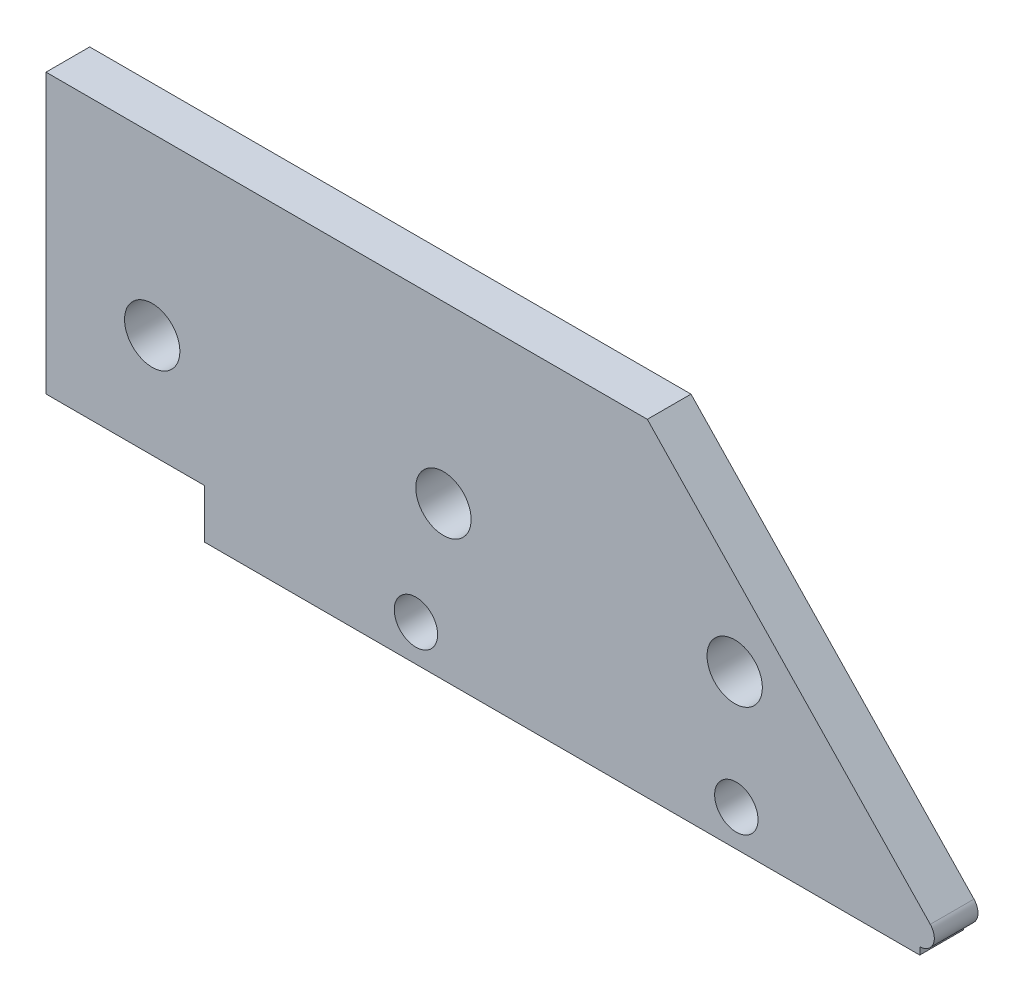
ISO-10303-21;
HEADER;
FILE_DESCRIPTION(('STEP AP214'),'2;1');
FILE_NAME('part.step','',(''),(''),'','','');
FILE_SCHEMA(('AUTOMOTIVE_DESIGN { 1 0 10303 214 1 1 1 1 }'));
ENDSEC;
DATA;
#1=APPLICATION_CONTEXT('core data for automotive mechanical design processes');
#2=APPLICATION_PROTOCOL_DEFINITION('international standard','automotive_design',2000,#1);
#3=PRODUCT_CONTEXT('',#1,'mechanical');
#4=PRODUCT('Part','Part','',(#3));
#5=PRODUCT_RELATED_PRODUCT_CATEGORY('part','',(#4));
#6=PRODUCT_DEFINITION_FORMATION('','',#4);
#7=PRODUCT_DEFINITION_CONTEXT('part definition',#1,'design');
#8=PRODUCT_DEFINITION('design','',#6,#7);
#9=PRODUCT_DEFINITION_SHAPE('','',#8);
#10=(LENGTH_UNIT() NAMED_UNIT(*) SI_UNIT(.MILLI.,.METRE.));
#11=(NAMED_UNIT(*) PLANE_ANGLE_UNIT() SI_UNIT($,.RADIAN.));
#12=(NAMED_UNIT(*) SI_UNIT($,.STERADIAN.) SOLID_ANGLE_UNIT());
#13=UNCERTAINTY_MEASURE_WITH_UNIT(LENGTH_MEASURE(1.E-05),#10,'distance_accuracy_value','');
#14=(GEOMETRIC_REPRESENTATION_CONTEXT(3) GLOBAL_UNCERTAINTY_ASSIGNED_CONTEXT((#13)) GLOBAL_UNIT_ASSIGNED_CONTEXT((#10,
#11,#12)) REPRESENTATION_CONTEXT('',''));
#15=CARTESIAN_POINT('',(0.,0.,0.));
#16=DIRECTION('',(0.,0.,1.));
#17=DIRECTION('',(1.,0.,0.));
#18=AXIS2_PLACEMENT_3D('',#15,#16,#17);
#19=CARTESIAN_POINT('',(105.301358772641,1.37499999999999,3.));
#20=DIRECTION('',(0.,0.,-1.));
#21=DIRECTION('',(-1.,0.,0.));
#22=AXIS2_PLACEMENT_3D('',#19,#20,#21);
#23=CYLINDRICAL_SURFACE('',#22,0.999999999999998);
#24=CARTESIAN_POINT('',(105.301358772641,1.37499999999999,0.));
#25=DIRECTION('',(0.,0.,1.));
#26=DIRECTION('',(1.,0.,0.));
#27=AXIS2_PLACEMENT_3D('',#24,#25,#26);
#28=CIRCLE('',#27,0.999999999999998);
#29=CARTESIAN_POINT('',(105.301358772641,0.374999999999994,0.));
#30=VERTEX_POINT('',#29);
#31=CARTESIAN_POINT('',(106.024068330656,2.06615186084797,0.));
#32=VERTEX_POINT('',#31);
#33=EDGE_CURVE('E172',#30,#32,#28,.T.);
#34=ORIENTED_EDGE('',*,*,#33,.T.);
#35=DIRECTION('',(0.,0.,-1.));
#36=VECTOR('',#35,1.);
#37=CARTESIAN_POINT('',(106.024068330656,2.06615186084797,3.));
#38=LINE('',#37,#36);
#39=CARTESIAN_POINT('',(106.024068330656,2.06615186084797,3.));
#40=VERTEX_POINT('',#39);
#41=EDGE_CURVE('E190',#40,#32,#38,.T.);
#42=ORIENTED_EDGE('',*,*,#41,.F.);
#43=CARTESIAN_POINT('',(105.301358772641,1.37499999999999,3.));
#44=DIRECTION('',(0.,0.,1.));
#45=DIRECTION('',(1.,0.,0.));
#46=AXIS2_PLACEMENT_3D('',#43,#44,#45);
#47=CIRCLE('',#46,0.999999999999998);
#48=CARTESIAN_POINT('',(105.301358772641,0.374999999999994,3.));
#49=VERTEX_POINT('',#48);
#50=EDGE_CURVE('E84',#49,#40,#47,.T.);
#51=ORIENTED_EDGE('',*,*,#50,.F.);
#52=DIRECTION('',(0.,0.,-1.));
#53=VECTOR('',#52,1.);
#54=CARTESIAN_POINT('',(105.301358772641,0.374999999999994,3.));
#55=LINE('',#54,#53);
#56=EDGE_CURVE('E40',#49,#30,#55,.T.);
#57=ORIENTED_EDGE('',*,*,#56,.T.);
#58=EDGE_LOOP('',(#34,#42,#51,#57));
#59=FACE_BOUND('',#58,.T.);
#60=ADVANCED_FACE('F33',(#59),#23,.T.);
#61=CARTESIAN_POINT('',(106.024068330656,2.06615186084797,3.));
#62=DIRECTION('',(-0.722709558015101,-0.691151860847974,0.));
#63=DIRECTION('',(0.691151860847974,-0.722709558015101,0.));
#64=AXIS2_PLACEMENT_3D('',#61,#62,#63);
#65=PLANE('',#64);
#66=DIRECTION('',(-0.691151860847974,0.722709558015101,0.));
#67=VECTOR('',#66,1.);
#68=CARTESIAN_POINT('',(106.024068330656,2.06615186084797,0.));
#69=LINE('',#68,#67);
#70=CARTESIAN_POINT('',(86.5935335759817,22.3838764884269,0.));
#71=VERTEX_POINT('',#70);
#72=EDGE_CURVE('E182',#32,#71,#69,.T.);
#73=ORIENTED_EDGE('',*,*,#72,.T.);
#74=DIRECTION('',(0.,0.,-1.));
#75=VECTOR('',#74,1.);
#76=CARTESIAN_POINT('',(86.5935335759817,22.3838764884269,3.));
#77=LINE('',#76,#75);
#78=CARTESIAN_POINT('',(86.5935335759817,22.3838764884269,3.));
#79=VERTEX_POINT('',#78);
#80=EDGE_CURVE('E188',#79,#71,#77,.T.);
#81=ORIENTED_EDGE('',*,*,#80,.F.);
#82=DIRECTION('',(-0.691151860847974,0.722709558015101,0.));
#83=VECTOR('',#82,1.);
#84=CARTESIAN_POINT('',(106.024068330656,2.06615186084797,3.));
#85=LINE('',#84,#83);
#86=EDGE_CURVE('E174',#40,#79,#85,.T.);
#87=ORIENTED_EDGE('',*,*,#86,.F.);
#88=ORIENTED_EDGE('',*,*,#41,.T.);
#89=EDGE_LOOP('',(#73,#81,#87,#88));
#90=FACE_BOUND('',#89,.T.);
#91=ADVANCED_FACE('F208',(#90),#65,.F.);
#92=CARTESIAN_POINT('',(86.5935335759817,22.3838764884269,3.));
#93=DIRECTION('',(0.,-1.,0.));
#94=DIRECTION('',(1.,0.,0.));
#95=AXIS2_PLACEMENT_3D('',#92,#93,#94);
#96=PLANE('',#95);
#97=DIRECTION('',(-1.,0.,0.));
#98=VECTOR('',#97,1.);
#99=CARTESIAN_POINT('',(86.5935335759817,22.3838764884269,0.));
#100=LINE('',#99,#98);
#101=CARTESIAN_POINT('',(45.301358772641,22.3838764884269,0.));
#102=VERTEX_POINT('',#101);
#103=EDGE_CURVE('E77',#71,#102,#100,.T.);
#104=ORIENTED_EDGE('',*,*,#103,.T.);
#105=DIRECTION('',(0.,0.,-1.));
#106=VECTOR('',#105,1.);
#107=CARTESIAN_POINT('',(45.301358772641,22.3838764884269,3.));
#108=LINE('',#107,#106);
#109=CARTESIAN_POINT('',(45.301358772641,22.3838764884269,3.));
#110=VERTEX_POINT('',#109);
#111=EDGE_CURVE('E180',#110,#102,#108,.T.);
#112=ORIENTED_EDGE('',*,*,#111,.F.);
#113=DIRECTION('',(-1.,0.,0.));
#114=VECTOR('',#113,1.);
#115=CARTESIAN_POINT('',(86.5935335759817,22.3838764884269,3.));
#116=LINE('',#115,#114);
#117=EDGE_CURVE('E56',#79,#110,#116,.T.);
#118=ORIENTED_EDGE('',*,*,#117,.F.);
#119=ORIENTED_EDGE('',*,*,#80,.T.);
#120=EDGE_LOOP('',(#104,#112,#118,#119));
#121=FACE_BOUND('',#120,.T.);
#122=ADVANCED_FACE('F204',(#121),#96,.F.);
#123=CARTESIAN_POINT('',(45.301358772641,22.3838764884269,3.));
#124=DIRECTION('',(1.,0.,0.));
#125=DIRECTION('',(0.,0.,-1.));
#126=AXIS2_PLACEMENT_3D('',#123,#124,#125);
#127=PLANE('',#126);
#128=DIRECTION('',(0.,-1.,0.));
#129=VECTOR('',#128,1.);
#130=CARTESIAN_POINT('',(45.301358772641,22.3838764884269,0.));
#131=LINE('',#130,#129);
#132=CARTESIAN_POINT('',(45.301358772641,3.24246980337965,0.));
#133=VERTEX_POINT('',#132);
#134=EDGE_CURVE('E175',#102,#133,#131,.T.);
#135=ORIENTED_EDGE('',*,*,#134,.T.);
#136=DIRECTION('',(0.,0.,1.));
#137=VECTOR('',#136,1.);
#138=CARTESIAN_POINT('',(45.301358772641,3.24246980337965,0.));
#139=LINE('',#138,#137);
#140=CARTESIAN_POINT('',(45.301358772641,3.24246980337965,3.));
#141=VERTEX_POINT('',#140);
#142=EDGE_CURVE('E115',#133,#141,#139,.T.);
#143=ORIENTED_EDGE('',*,*,#142,.T.);
#144=DIRECTION('',(0.,-1.,0.));
#145=VECTOR('',#144,1.);
#146=CARTESIAN_POINT('',(45.301358772641,22.3838764884269,3.));
#147=LINE('',#146,#145);
#148=EDGE_CURVE('E178',#110,#141,#147,.T.);
#149=ORIENTED_EDGE('',*,*,#148,.F.);
#150=ORIENTED_EDGE('',*,*,#111,.T.);
#151=EDGE_LOOP('',(#135,#143,#149,#150));
#152=FACE_BOUND('',#151,.T.);
#153=ADVANCED_FACE('F202',(#152),#127,.F.);
#154=CARTESIAN_POINT('',(105.301358772641,1.37499999999999,3.));
#155=DIRECTION('',(0.,0.,1.));
#156=DIRECTION('',(1.,0.,0.));
#157=AXIS2_PLACEMENT_3D('',#154,#155,#156);
#158=PLANE('',#157);
#159=CARTESIAN_POINT('',(70.7051831779957,2.375,3.));
#160=DIRECTION('',(0.,0.,1.));
#161=DIRECTION('',(1.,0.,0.));
#162=AXIS2_PLACEMENT_3D('',#159,#160,#161);
#163=CIRCLE('',#162,1.48999999999999);
#164=CARTESIAN_POINT('',(72.1951831779957,2.375,3.));
#165=VERTEX_POINT('',#164);
#166=EDGE_CURVE('E138',#165,#165,#163,.T.);
#167=ORIENTED_EDGE('',*,*,#166,.F.);
#168=EDGE_LOOP('',(#167));
#169=FACE_BOUND('',#168,.T.);
#170=CARTESIAN_POINT('',(92.7051831779958,2.375,3.));
#171=DIRECTION('',(0.,0.,1.));
#172=DIRECTION('',(1.,0.,0.));
#173=AXIS2_PLACEMENT_3D('',#170,#171,#172);
#174=CIRCLE('',#173,1.48999999999999);
#175=CARTESIAN_POINT('',(94.1951831779958,2.375,3.));
#176=VERTEX_POINT('',#175);
#177=EDGE_CURVE('E145',#176,#176,#174,.T.);
#178=ORIENTED_EDGE('',*,*,#177,.F.);
#179=EDGE_LOOP('',(#178));
#180=FACE_BOUND('',#179,.T.);
#181=CARTESIAN_POINT('',(72.5935335759817,10.375,3.));
#182=DIRECTION('',(0.,0.,1.));
#183=DIRECTION('',(1.,0.,0.));
#184=AXIS2_PLACEMENT_3D('',#181,#182,#183);
#185=CIRCLE('',#184,1.9);
#186=CARTESIAN_POINT('',(74.4935335759817,10.375,3.));
#187=VERTEX_POINT('',#186);
#188=EDGE_CURVE('E157',#187,#187,#185,.T.);
#189=ORIENTED_EDGE('',*,*,#188,.F.);
#190=EDGE_LOOP('',(#189));
#191=FACE_BOUND('',#190,.T.);
#192=CARTESIAN_POINT('',(92.5935335759817,10.375,3.));
#193=DIRECTION('',(0.,0.,1.));
#194=DIRECTION('',(1.,0.,0.));
#195=AXIS2_PLACEMENT_3D('',#192,#193,#194);
#196=CIRCLE('',#195,1.9);
#197=CARTESIAN_POINT('',(94.4935335759817,10.375,3.));
#198=VERTEX_POINT('',#197);
#199=EDGE_CURVE('E152',#198,#198,#196,.T.);
#200=ORIENTED_EDGE('',*,*,#199,.F.);
#201=EDGE_LOOP('',(#200));
#202=FACE_BOUND('',#201,.T.);
#203=CARTESIAN_POINT('',(52.5935335759817,10.375,3.));
#204=DIRECTION('',(0.,0.,1.));
#205=DIRECTION('',(1.,0.,0.));
#206=AXIS2_PLACEMENT_3D('',#203,#204,#205);
#207=CIRCLE('',#206,1.90000000000001);
#208=CARTESIAN_POINT('',(54.4935335759817,10.375,3.));
#209=VERTEX_POINT('',#208);
#210=EDGE_CURVE('E163',#209,#209,#207,.T.);
#211=ORIENTED_EDGE('',*,*,#210,.F.);
#212=EDGE_LOOP('',(#211));
#213=FACE_BOUND('',#212,.T.);
#214=DIRECTION('',(-1.,0.,0.));
#215=VECTOR('',#214,1.);
#216=CARTESIAN_POINT('',(105.301358772641,3.24246980337965,3.));
#217=LINE('',#216,#215);
#218=CARTESIAN_POINT('',(56.1877019769961,3.24246980337965,3.));
#219=VERTEX_POINT('',#218);
#220=EDGE_CURVE('E113',#219,#141,#217,.T.);
#221=ORIENTED_EDGE('',*,*,#220,.F.);
#222=DIRECTION('',(0.,1.,0.));
#223=VECTOR('',#222,1.);
#224=CARTESIAN_POINT('',(56.1877019769961,1.37499999999999,3.));
#225=LINE('',#224,#223);
#226=CARTESIAN_POINT('',(56.1877019769961,-0.125000000000012,3.));
#227=VERTEX_POINT('',#226);
#228=EDGE_CURVE('E107',#227,#219,#225,.T.);
#229=ORIENTED_EDGE('',*,*,#228,.F.);
#230=DIRECTION('',(1.,0.,0.));
#231=VECTOR('',#230,1.);
#232=CARTESIAN_POINT('',(105.301358772641,-0.125000000000006,3.));
#233=LINE('',#232,#231);
#234=CARTESIAN_POINT('',(105.301358772641,-0.125000000000006,3.));
#235=VERTEX_POINT('',#234);
#236=EDGE_CURVE('E112',#227,#235,#233,.T.);
#237=ORIENTED_EDGE('',*,*,#236,.T.);
#238=DIRECTION('',(0.,1.,0.));
#239=VECTOR('',#238,1.);
#240=CARTESIAN_POINT('',(105.301358772641,0.374999999999995,3.));
#241=LINE('',#240,#239);
#242=EDGE_CURVE('E128',#235,#49,#241,.T.);
#243=ORIENTED_EDGE('',*,*,#242,.T.);
#244=ORIENTED_EDGE('',*,*,#50,.T.);
#245=ORIENTED_EDGE('',*,*,#86,.T.);
#246=ORIENTED_EDGE('',*,*,#117,.T.);
#247=ORIENTED_EDGE('',*,*,#148,.T.);
#248=EDGE_LOOP('',(#221,#229,#237,#243,#244,#245,#246,#247));
#249=FACE_BOUND('',#248,.T.);
#250=ADVANCED_FACE('F109',(#169,#180,#191,#202,#213,#249),#158,.T.);
#251=CARTESIAN_POINT('',(105.301358772641,1.37499999999999,0.));
#252=DIRECTION('',(0.,0.,1.));
#253=DIRECTION('',(1.,0.,0.));
#254=AXIS2_PLACEMENT_3D('',#251,#252,#253);
#255=PLANE('',#254);
#256=CARTESIAN_POINT('',(70.7051831779957,2.375,0.));
#257=DIRECTION('',(0.,0.,1.));
#258=DIRECTION('',(1.,0.,0.));
#259=AXIS2_PLACEMENT_3D('',#256,#257,#258);
#260=CIRCLE('',#259,1.48999999999999);
#261=CARTESIAN_POINT('',(72.1951831779957,2.375,0.));
#262=VERTEX_POINT('',#261);
#263=EDGE_CURVE('E135',#262,#262,#260,.T.);
#264=ORIENTED_EDGE('',*,*,#263,.T.);
#265=EDGE_LOOP('',(#264));
#266=FACE_BOUND('',#265,.T.);
#267=CARTESIAN_POINT('',(92.7051831779958,2.375,0.));
#268=DIRECTION('',(0.,0.,1.));
#269=DIRECTION('',(1.,0.,0.));
#270=AXIS2_PLACEMENT_3D('',#267,#268,#269);
#271=CIRCLE('',#270,1.48999999999999);
#272=CARTESIAN_POINT('',(94.1951831779958,2.375,0.));
#273=VERTEX_POINT('',#272);
#274=EDGE_CURVE('E142',#273,#273,#271,.T.);
#275=ORIENTED_EDGE('',*,*,#274,.T.);
#276=EDGE_LOOP('',(#275));
#277=FACE_BOUND('',#276,.T.);
#278=CARTESIAN_POINT('',(72.5935335759817,10.375,0.));
#279=DIRECTION('',(0.,0.,1.));
#280=DIRECTION('',(1.,0.,0.));
#281=AXIS2_PLACEMENT_3D('',#278,#279,#280);
#282=CIRCLE('',#281,1.9);
#283=CARTESIAN_POINT('',(74.4935335759817,10.375,0.));
#284=VERTEX_POINT('',#283);
#285=EDGE_CURVE('E149',#284,#284,#282,.T.);
#286=ORIENTED_EDGE('',*,*,#285,.T.);
#287=EDGE_LOOP('',(#286));
#288=FACE_BOUND('',#287,.T.);
#289=CARTESIAN_POINT('',(92.5935335759817,10.375,0.));
#290=DIRECTION('',(0.,0.,1.));
#291=DIRECTION('',(1.,0.,0.));
#292=AXIS2_PLACEMENT_3D('',#289,#290,#291);
#293=CIRCLE('',#292,1.9);
#294=CARTESIAN_POINT('',(94.4935335759817,10.375,0.));
#295=VERTEX_POINT('',#294);
#296=EDGE_CURVE('E148',#295,#295,#293,.T.);
#297=ORIENTED_EDGE('',*,*,#296,.T.);
#298=EDGE_LOOP('',(#297));
#299=FACE_BOUND('',#298,.T.);
#300=CARTESIAN_POINT('',(52.5935335759817,10.375,0.));
#301=DIRECTION('',(0.,0.,1.));
#302=DIRECTION('',(1.,0.,0.));
#303=AXIS2_PLACEMENT_3D('',#300,#301,#302);
#304=CIRCLE('',#303,1.90000000000001);
#305=CARTESIAN_POINT('',(54.4935335759817,10.375,0.));
#306=VERTEX_POINT('',#305);
#307=EDGE_CURVE('E160',#306,#306,#304,.T.);
#308=ORIENTED_EDGE('',*,*,#307,.T.);
#309=EDGE_LOOP('',(#308));
#310=FACE_BOUND('',#309,.T.);
#311=DIRECTION('',(0.,1.,0.));
#312=VECTOR('',#311,1.);
#313=CARTESIAN_POINT('',(56.1877019769961,1.37499999999999,0.));
#314=LINE('',#313,#312);
#315=CARTESIAN_POINT('',(56.1877019769961,-0.125000000000012,0.));
#316=VERTEX_POINT('',#315);
#317=CARTESIAN_POINT('',(56.1877019769961,3.24246980337965,0.));
#318=VERTEX_POINT('',#317);
#319=EDGE_CURVE('E11',#316,#318,#314,.T.);
#320=ORIENTED_EDGE('',*,*,#319,.T.);
#321=DIRECTION('',(-1.,0.,0.));
#322=VECTOR('',#321,1.);
#323=CARTESIAN_POINT('',(45.301358772641,3.24246980337965,0.));
#324=LINE('',#323,#322);
#325=EDGE_CURVE('E47',#318,#133,#324,.T.);
#326=ORIENTED_EDGE('',*,*,#325,.T.);
#327=ORIENTED_EDGE('',*,*,#134,.F.);
#328=ORIENTED_EDGE('',*,*,#103,.F.);
#329=ORIENTED_EDGE('',*,*,#72,.F.);
#330=ORIENTED_EDGE('',*,*,#33,.F.);
#331=DIRECTION('',(0.,-1.,0.));
#332=VECTOR('',#331,1.);
#333=CARTESIAN_POINT('',(105.301358772641,0.374999999999995,0.));
#334=LINE('',#333,#332);
#335=CARTESIAN_POINT('',(105.301358772641,-0.125000000000006,0.));
#336=VERTEX_POINT('',#335);
#337=EDGE_CURVE('E139',#30,#336,#334,.T.);
#338=ORIENTED_EDGE('',*,*,#337,.T.);
#339=DIRECTION('',(-1.,0.,0.));
#340=VECTOR('',#339,1.);
#341=CARTESIAN_POINT('',(105.301358772641,-0.125000000000006,0.));
#342=LINE('',#341,#340);
#343=EDGE_CURVE('E133',#336,#316,#342,.T.);
#344=ORIENTED_EDGE('',*,*,#343,.T.);
#345=EDGE_LOOP('',(#320,#326,#327,#328,#329,#330,#338,#344));
#346=FACE_BOUND('',#345,.T.);
#347=ADVANCED_FACE('F197',(#266,#277,#288,#299,#310,#346),#255,.F.);
#348=CARTESIAN_POINT('',(56.1877019769961,3.24246980337965,0.));
#349=DIRECTION('',(1.,0.,0.));
#350=DIRECTION('',(0.,0.,-1.));
#351=AXIS2_PLACEMENT_3D('',#348,#349,#350);
#352=PLANE('',#351);
#353=ORIENTED_EDGE('',*,*,#228,.T.);
#354=DIRECTION('',(0.,0.,1.));
#355=VECTOR('',#354,1.);
#356=CARTESIAN_POINT('',(56.1877019769961,3.24246980337965,0.));
#357=LINE('',#356,#355);
#358=EDGE_CURVE('E167',#318,#219,#357,.T.);
#359=ORIENTED_EDGE('',*,*,#358,.F.);
#360=ORIENTED_EDGE('',*,*,#319,.F.);
#361=DIRECTION('',(0.,0.,1.));
#362=VECTOR('',#361,1.);
#363=CARTESIAN_POINT('',(56.1877019769961,-0.125000000000012,-49.1162018466453));
#364=LINE('',#363,#362);
#365=EDGE_CURVE('E118',#316,#227,#364,.T.);
#366=ORIENTED_EDGE('',*,*,#365,.T.);
#367=EDGE_LOOP('',(#353,#359,#360,#366));
#368=FACE_BOUND('',#367,.T.);
#369=ADVANCED_FACE('F119',(#368),#352,.F.);
#370=CARTESIAN_POINT('',(45.301358772641,3.24246980337965,0.));
#371=DIRECTION('',(0.,1.,0.));
#372=DIRECTION('',(0.,0.,1.));
#373=AXIS2_PLACEMENT_3D('',#370,#371,#372);
#374=PLANE('',#373);
#375=ORIENTED_EDGE('',*,*,#220,.T.);
#376=ORIENTED_EDGE('',*,*,#142,.F.);
#377=ORIENTED_EDGE('',*,*,#325,.F.);
#378=ORIENTED_EDGE('',*,*,#358,.T.);
#379=EDGE_LOOP('',(#375,#376,#377,#378));
#380=FACE_BOUND('',#379,.T.);
#381=ADVANCED_FACE('F226',(#380),#374,.F.);
#382=CARTESIAN_POINT('',(52.5935335759817,10.375,0.));
#383=DIRECTION('',(0.,0.,1.));
#384=DIRECTION('',(1.,0.,0.));
#385=AXIS2_PLACEMENT_3D('',#382,#383,#384);
#386=CYLINDRICAL_SURFACE('',#385,1.90000000000001);
#387=ORIENTED_EDGE('',*,*,#210,.T.);
#388=EDGE_LOOP('',(#387));
#389=FACE_BOUND('',#388,.T.);
#390=ORIENTED_EDGE('',*,*,#307,.F.);
#391=EDGE_LOOP('',(#390));
#392=FACE_BOUND('',#391,.T.);
#393=ADVANCED_FACE('F229',(#389,#392),#386,.F.);
#394=CARTESIAN_POINT('',(92.5935335759817,10.375,0.));
#395=DIRECTION('',(0.,0.,1.));
#396=DIRECTION('',(1.,0.,0.));
#397=AXIS2_PLACEMENT_3D('',#394,#395,#396);
#398=CYLINDRICAL_SURFACE('',#397,1.9);
#399=ORIENTED_EDGE('',*,*,#199,.T.);
#400=EDGE_LOOP('',(#399));
#401=FACE_BOUND('',#400,.T.);
#402=ORIENTED_EDGE('',*,*,#296,.F.);
#403=EDGE_LOOP('',(#402));
#404=FACE_BOUND('',#403,.T.);
#405=ADVANCED_FACE('F232',(#401,#404),#398,.F.);
#406=CARTESIAN_POINT('',(72.5935335759817,10.375,0.));
#407=DIRECTION('',(0.,0.,1.));
#408=DIRECTION('',(1.,0.,0.));
#409=AXIS2_PLACEMENT_3D('',#406,#407,#408);
#410=CYLINDRICAL_SURFACE('',#409,1.9);
#411=ORIENTED_EDGE('',*,*,#188,.T.);
#412=EDGE_LOOP('',(#411));
#413=FACE_BOUND('',#412,.T.);
#414=ORIENTED_EDGE('',*,*,#285,.F.);
#415=EDGE_LOOP('',(#414));
#416=FACE_BOUND('',#415,.T.);
#417=ADVANCED_FACE('F236',(#413,#416),#410,.F.);
#418=CARTESIAN_POINT('',(92.7051831779958,2.375,0.));
#419=DIRECTION('',(0.,0.,1.));
#420=DIRECTION('',(1.,0.,0.));
#421=AXIS2_PLACEMENT_3D('',#418,#419,#420);
#422=CYLINDRICAL_SURFACE('',#421,1.48999999999999);
#423=ORIENTED_EDGE('',*,*,#177,.T.);
#424=EDGE_LOOP('',(#423));
#425=FACE_BOUND('',#424,.T.);
#426=ORIENTED_EDGE('',*,*,#274,.F.);
#427=EDGE_LOOP('',(#426));
#428=FACE_BOUND('',#427,.T.);
#429=ADVANCED_FACE('F240',(#425,#428),#422,.F.);
#430=CARTESIAN_POINT('',(70.7051831779957,2.375,0.));
#431=DIRECTION('',(0.,0.,1.));
#432=DIRECTION('',(1.,0.,0.));
#433=AXIS2_PLACEMENT_3D('',#430,#431,#432);
#434=CYLINDRICAL_SURFACE('',#433,1.48999999999999);
#435=ORIENTED_EDGE('',*,*,#166,.T.);
#436=EDGE_LOOP('',(#435));
#437=FACE_BOUND('',#436,.T.);
#438=ORIENTED_EDGE('',*,*,#263,.F.);
#439=EDGE_LOOP('',(#438));
#440=FACE_BOUND('',#439,.T.);
#441=ADVANCED_FACE('F244',(#437,#440),#434,.F.);
#442=CARTESIAN_POINT('',(105.301358772641,0.374999999999995,-49.1162018466453));
#443=DIRECTION('',(1.,0.,0.));
#444=DIRECTION('',(0.,1.,0.));
#445=AXIS2_PLACEMENT_3D('',#442,#443,#444);
#446=PLANE('',#445);
#447=ORIENTED_EDGE('',*,*,#337,.F.);
#448=ORIENTED_EDGE('',*,*,#56,.F.);
#449=ORIENTED_EDGE('',*,*,#242,.F.);
#450=DIRECTION('',(0.,0.,1.));
#451=VECTOR('',#450,1.);
#452=CARTESIAN_POINT('',(105.301358772641,-0.125000000000006,-49.1162018466453));
#453=LINE('',#452,#451);
#454=EDGE_CURVE('E123',#336,#235,#453,.T.);
#455=ORIENTED_EDGE('',*,*,#454,.F.);
#456=EDGE_LOOP('',(#447,#448,#449,#455));
#457=FACE_BOUND('',#456,.T.);
#458=ADVANCED_FACE('F198',(#457),#446,.T.);
#459=CARTESIAN_POINT('',(105.301358772641,-0.125000000000006,-49.1162018466453));
#460=DIRECTION('',(0.,-1.,0.));
#461=DIRECTION('',(1.,0.,0.));
#462=AXIS2_PLACEMENT_3D('',#459,#460,#461);
#463=PLANE('',#462);
#464=ORIENTED_EDGE('',*,*,#343,.F.);
#465=ORIENTED_EDGE('',*,*,#454,.T.);
#466=ORIENTED_EDGE('',*,*,#236,.F.);
#467=ORIENTED_EDGE('',*,*,#365,.F.);
#468=EDGE_LOOP('',(#464,#465,#466,#467));
#469=FACE_BOUND('',#468,.T.);
#470=ADVANCED_FACE('F125',(#469),#463,.T.);
#471=CLOSED_SHELL('',(#60,#91,#122,#153,#250,#347,#369,#381,#393,#405,#417,#429,#441,#458,#470));
#472=MANIFOLD_SOLID_BREP('B2',#471);
#473=ADVANCED_BREP_SHAPE_REPRESENTATION('',(#18,#472),#14);
#474=SHAPE_DEFINITION_REPRESENTATION(#9,#473);
ENDSEC;
END-ISO-10303-21;
